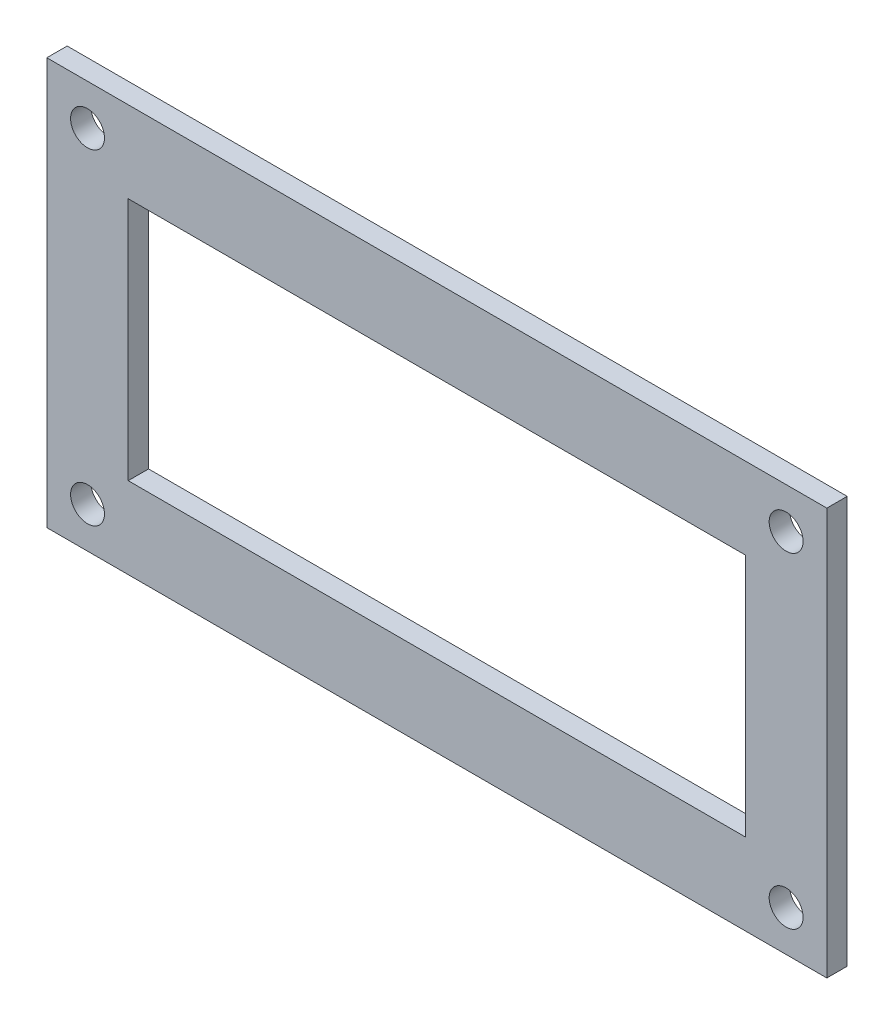
ISO-10303-21;
HEADER;
FILE_DESCRIPTION(('STEP AP214'),'2;1');
FILE_NAME('part.step','',(''),(''),'','','');
FILE_SCHEMA(('AUTOMOTIVE_DESIGN { 1 0 10303 214 1 1 1 1 }'));
ENDSEC;
DATA;
#1=APPLICATION_CONTEXT('core data for automotive mechanical design processes');
#2=APPLICATION_PROTOCOL_DEFINITION('international standard','automotive_design',2000,#1);
#3=PRODUCT_CONTEXT('',#1,'mechanical');
#4=PRODUCT('Part','Part','',(#3));
#5=PRODUCT_RELATED_PRODUCT_CATEGORY('part','',(#4));
#6=PRODUCT_DEFINITION_FORMATION('','',#4);
#7=PRODUCT_DEFINITION_CONTEXT('part definition',#1,'design');
#8=PRODUCT_DEFINITION('design','',#6,#7);
#9=PRODUCT_DEFINITION_SHAPE('','',#8);
#10=(LENGTH_UNIT() NAMED_UNIT(*) SI_UNIT(.MILLI.,.METRE.));
#11=(NAMED_UNIT(*) PLANE_ANGLE_UNIT() SI_UNIT($,.RADIAN.));
#12=(NAMED_UNIT(*) SI_UNIT($,.STERADIAN.) SOLID_ANGLE_UNIT());
#13=UNCERTAINTY_MEASURE_WITH_UNIT(LENGTH_MEASURE(1.E-05),#10,'distance_accuracy_value','');
#14=(GEOMETRIC_REPRESENTATION_CONTEXT(3) GLOBAL_UNCERTAINTY_ASSIGNED_CONTEXT((#13)) GLOBAL_UNIT_ASSIGNED_CONTEXT((#10,
#11,#12)) REPRESENTATION_CONTEXT('',''));
#15=CARTESIAN_POINT('',(0.,0.,0.));
#16=DIRECTION('',(0.,0.,1.));
#17=DIRECTION('',(1.,0.,0.));
#18=AXIS2_PLACEMENT_3D('',#15,#16,#17);
#19=CARTESIAN_POINT('',(0.,0.,3.));
#20=DIRECTION('',(0.,0.,-1.));
#21=DIRECTION('',(-1.,0.,0.));
#22=AXIS2_PLACEMENT_3D('',#19,#20,#21);
#23=PLANE('',#22);
#24=CARTESIAN_POINT('',(109.,6.,3.));
#25=DIRECTION('',(0.,0.,1.));
#26=DIRECTION('',(1.,0.,0.));
#27=AXIS2_PLACEMENT_3D('',#24,#25,#26);
#28=CIRCLE('',#27,2.49999999999999);
#29=CARTESIAN_POINT('',(111.5,6.,3.));
#30=VERTEX_POINT('',#29);
#31=EDGE_CURVE('E134',#30,#30,#28,.T.);
#32=ORIENTED_EDGE('',*,*,#31,.F.);
#33=EDGE_LOOP('',(#32));
#34=FACE_BOUND('',#33,.T.);
#35=CARTESIAN_POINT('',(6.,54.,3.));
#36=DIRECTION('',(0.,0.,1.));
#37=DIRECTION('',(1.,0.,0.));
#38=AXIS2_PLACEMENT_3D('',#35,#36,#37);
#39=CIRCLE('',#38,2.5);
#40=CARTESIAN_POINT('',(8.5,54.,3.));
#41=VERTEX_POINT('',#40);
#42=EDGE_CURVE('E146',#41,#41,#39,.T.);
#43=ORIENTED_EDGE('',*,*,#42,.F.);
#44=EDGE_LOOP('',(#43));
#45=FACE_BOUND('',#44,.T.);
#46=DIRECTION('',(0.,-1.,0.));
#47=VECTOR('',#46,1.);
#48=CARTESIAN_POINT('',(0.,0.,3.));
#49=LINE('',#48,#47);
#50=CARTESIAN_POINT('',(0.,60.,3.));
#51=VERTEX_POINT('',#50);
#52=CARTESIAN_POINT('',(0.,0.,3.));
#53=VERTEX_POINT('',#52);
#54=EDGE_CURVE('E158',#51,#53,#49,.T.);
#55=ORIENTED_EDGE('',*,*,#54,.T.);
#56=DIRECTION('',(1.,0.,0.));
#57=VECTOR('',#56,1.);
#58=CARTESIAN_POINT('',(0.,0.,3.));
#59=LINE('',#58,#57);
#60=CARTESIAN_POINT('',(115.,0.,3.));
#61=VERTEX_POINT('',#60);
#62=EDGE_CURVE('E161',#53,#61,#59,.T.);
#63=ORIENTED_EDGE('',*,*,#62,.T.);
#64=DIRECTION('',(0.,1.,0.));
#65=VECTOR('',#64,1.);
#66=CARTESIAN_POINT('',(115.,0.,3.));
#67=LINE('',#66,#65);
#68=CARTESIAN_POINT('',(115.,60.,3.));
#69=VERTEX_POINT('',#68);
#70=EDGE_CURVE('E164',#61,#69,#67,.T.);
#71=ORIENTED_EDGE('',*,*,#70,.T.);
#72=DIRECTION('',(-1.,0.,0.));
#73=VECTOR('',#72,1.);
#74=CARTESIAN_POINT('',(0.,60.,3.));
#75=LINE('',#74,#73);
#76=EDGE_CURVE('E166',#69,#51,#75,.T.);
#77=ORIENTED_EDGE('',*,*,#76,.T.);
#78=EDGE_LOOP('',(#55,#63,#71,#77));
#79=FACE_BOUND('',#78,.T.);
#80=CARTESIAN_POINT('',(6.,6.,3.));
#81=DIRECTION('',(0.,0.,1.));
#82=DIRECTION('',(1.,0.,0.));
#83=AXIS2_PLACEMENT_3D('',#80,#81,#82);
#84=CIRCLE('',#83,2.5);
#85=CARTESIAN_POINT('',(8.5,6.,3.));
#86=VERTEX_POINT('',#85);
#87=EDGE_CURVE('E152',#86,#86,#84,.T.);
#88=ORIENTED_EDGE('',*,*,#87,.F.);
#89=EDGE_LOOP('',(#88));
#90=FACE_BOUND('',#89,.T.);
#91=CARTESIAN_POINT('',(109.,54.,3.));
#92=DIRECTION('',(0.,0.,1.));
#93=DIRECTION('',(1.,0.,0.));
#94=AXIS2_PLACEMENT_3D('',#91,#92,#93);
#95=CIRCLE('',#94,2.50000000000001);
#96=CARTESIAN_POINT('',(111.5,54.,3.));
#97=VERTEX_POINT('',#96);
#98=EDGE_CURVE('E140',#97,#97,#95,.T.);
#99=ORIENTED_EDGE('',*,*,#98,.F.);
#100=EDGE_LOOP('',(#99));
#101=FACE_BOUND('',#100,.T.);
#102=DIRECTION('',(0.,-1.,0.));
#103=VECTOR('',#102,1.);
#104=CARTESIAN_POINT('',(12.,48.,3.));
#105=LINE('',#104,#103);
#106=CARTESIAN_POINT('',(12.,48.,3.));
#107=VERTEX_POINT('',#106);
#108=CARTESIAN_POINT('',(12.,12.,3.));
#109=VERTEX_POINT('',#108);
#110=EDGE_CURVE('E98',#107,#109,#105,.T.);
#111=ORIENTED_EDGE('',*,*,#110,.F.);
#112=DIRECTION('',(-1.,0.,0.));
#113=VECTOR('',#112,1.);
#114=CARTESIAN_POINT('',(12.,48.,3.));
#115=LINE('',#114,#113);
#116=CARTESIAN_POINT('',(103.,48.,3.));
#117=VERTEX_POINT('',#116);
#118=EDGE_CURVE('E120',#117,#107,#115,.T.);
#119=ORIENTED_EDGE('',*,*,#118,.F.);
#120=DIRECTION('',(0.,1.,0.));
#121=VECTOR('',#120,1.);
#122=CARTESIAN_POINT('',(103.,48.,3.));
#123=LINE('',#122,#121);
#124=CARTESIAN_POINT('',(103.,12.,3.));
#125=VERTEX_POINT('',#124);
#126=EDGE_CURVE('E118',#125,#117,#123,.T.);
#127=ORIENTED_EDGE('',*,*,#126,.F.);
#128=DIRECTION('',(1.,0.,0.));
#129=VECTOR('',#128,1.);
#130=CARTESIAN_POINT('',(12.,12.,3.));
#131=LINE('',#130,#129);
#132=EDGE_CURVE('E106',#109,#125,#131,.T.);
#133=ORIENTED_EDGE('',*,*,#132,.F.);
#134=EDGE_LOOP('',(#111,#119,#127,#133));
#135=FACE_BOUND('',#134,.T.);
#136=ADVANCED_FACE('F33',(#34,#45,#79,#90,#101,#135),#23,.F.);
#137=CARTESIAN_POINT('',(0.,0.,0.));
#138=DIRECTION('',(0.,0.,-1.));
#139=DIRECTION('',(-1.,0.,0.));
#140=AXIS2_PLACEMENT_3D('',#137,#138,#139);
#141=PLANE('',#140);
#142=CARTESIAN_POINT('',(109.,6.,0.));
#143=DIRECTION('',(0.,0.,1.));
#144=DIRECTION('',(1.,0.,0.));
#145=AXIS2_PLACEMENT_3D('',#142,#143,#144);
#146=CIRCLE('',#145,2.49999999999999);
#147=CARTESIAN_POINT('',(111.5,6.,0.));
#148=VERTEX_POINT('',#147);
#149=EDGE_CURVE('E114',#148,#148,#146,.T.);
#150=ORIENTED_EDGE('',*,*,#149,.T.);
#151=EDGE_LOOP('',(#150));
#152=FACE_BOUND('',#151,.T.);
#153=CARTESIAN_POINT('',(6.,54.,0.));
#154=DIRECTION('',(0.,0.,1.));
#155=DIRECTION('',(1.,0.,0.));
#156=AXIS2_PLACEMENT_3D('',#153,#154,#155);
#157=CIRCLE('',#156,2.5);
#158=CARTESIAN_POINT('',(8.5,54.,0.));
#159=VERTEX_POINT('',#158);
#160=EDGE_CURVE('E143',#159,#159,#157,.T.);
#161=ORIENTED_EDGE('',*,*,#160,.T.);
#162=EDGE_LOOP('',(#161));
#163=FACE_BOUND('',#162,.T.);
#164=DIRECTION('',(0.,-1.,0.));
#165=VECTOR('',#164,1.);
#166=CARTESIAN_POINT('',(0.,0.,0.));
#167=LINE('',#166,#165);
#168=CARTESIAN_POINT('',(0.,60.,0.));
#169=VERTEX_POINT('',#168);
#170=CARTESIAN_POINT('',(0.,0.,0.));
#171=VERTEX_POINT('',#170);
#172=EDGE_CURVE('E155',#169,#171,#167,.T.);
#173=ORIENTED_EDGE('',*,*,#172,.F.);
#174=DIRECTION('',(-1.,0.,0.));
#175=VECTOR('',#174,1.);
#176=CARTESIAN_POINT('',(0.,60.,0.));
#177=LINE('',#176,#175);
#178=CARTESIAN_POINT('',(115.,60.,0.));
#179=VERTEX_POINT('',#178);
#180=EDGE_CURVE('E162',#179,#169,#177,.T.);
#181=ORIENTED_EDGE('',*,*,#180,.F.);
#182=DIRECTION('',(0.,1.,0.));
#183=VECTOR('',#182,1.);
#184=CARTESIAN_POINT('',(115.,0.,0.));
#185=LINE('',#184,#183);
#186=CARTESIAN_POINT('',(115.,0.,0.));
#187=VERTEX_POINT('',#186);
#188=EDGE_CURVE('E173',#187,#179,#185,.T.);
#189=ORIENTED_EDGE('',*,*,#188,.F.);
#190=DIRECTION('',(1.,0.,0.));
#191=VECTOR('',#190,1.);
#192=CARTESIAN_POINT('',(0.,0.,0.));
#193=LINE('',#192,#191);
#194=EDGE_CURVE('E171',#171,#187,#193,.T.);
#195=ORIENTED_EDGE('',*,*,#194,.F.);
#196=EDGE_LOOP('',(#173,#181,#189,#195));
#197=FACE_BOUND('',#196,.T.);
#198=CARTESIAN_POINT('',(6.,6.,0.));
#199=DIRECTION('',(0.,0.,1.));
#200=DIRECTION('',(1.,0.,0.));
#201=AXIS2_PLACEMENT_3D('',#198,#199,#200);
#202=CIRCLE('',#201,2.5);
#203=CARTESIAN_POINT('',(8.5,6.,0.));
#204=VERTEX_POINT('',#203);
#205=EDGE_CURVE('E149',#204,#204,#202,.T.);
#206=ORIENTED_EDGE('',*,*,#205,.T.);
#207=EDGE_LOOP('',(#206));
#208=FACE_BOUND('',#207,.T.);
#209=CARTESIAN_POINT('',(109.,54.,0.));
#210=DIRECTION('',(0.,0.,1.));
#211=DIRECTION('',(1.,0.,0.));
#212=AXIS2_PLACEMENT_3D('',#209,#210,#211);
#213=CIRCLE('',#212,2.50000000000001);
#214=CARTESIAN_POINT('',(111.5,54.,0.));
#215=VERTEX_POINT('',#214);
#216=EDGE_CURVE('E137',#215,#215,#213,.T.);
#217=ORIENTED_EDGE('',*,*,#216,.T.);
#218=EDGE_LOOP('',(#217));
#219=FACE_BOUND('',#218,.T.);
#220=DIRECTION('',(-1.,0.,0.));
#221=VECTOR('',#220,1.);
#222=CARTESIAN_POINT('',(12.,48.,0.));
#223=LINE('',#222,#221);
#224=CARTESIAN_POINT('',(103.,48.,0.));
#225=VERTEX_POINT('',#224);
#226=CARTESIAN_POINT('',(12.,48.,0.));
#227=VERTEX_POINT('',#226);
#228=EDGE_CURVE('E107',#225,#227,#223,.T.);
#229=ORIENTED_EDGE('',*,*,#228,.T.);
#230=DIRECTION('',(0.,-1.,0.));
#231=VECTOR('',#230,1.);
#232=CARTESIAN_POINT('',(12.,48.,0.));
#233=LINE('',#232,#231);
#234=CARTESIAN_POINT('',(12.,12.,0.));
#235=VERTEX_POINT('',#234);
#236=EDGE_CURVE('E56',#227,#235,#233,.T.);
#237=ORIENTED_EDGE('',*,*,#236,.T.);
#238=DIRECTION('',(1.,0.,0.));
#239=VECTOR('',#238,1.);
#240=CARTESIAN_POINT('',(12.,12.,0.));
#241=LINE('',#240,#239);
#242=CARTESIAN_POINT('',(103.,12.,0.));
#243=VERTEX_POINT('',#242);
#244=EDGE_CURVE('E113',#235,#243,#241,.T.);
#245=ORIENTED_EDGE('',*,*,#244,.T.);
#246=DIRECTION('',(0.,1.,0.));
#247=VECTOR('',#246,1.);
#248=CARTESIAN_POINT('',(103.,48.,0.));
#249=LINE('',#248,#247);
#250=EDGE_CURVE('E126',#243,#225,#249,.T.);
#251=ORIENTED_EDGE('',*,*,#250,.T.);
#252=EDGE_LOOP('',(#229,#237,#245,#251));
#253=FACE_BOUND('',#252,.T.);
#254=ADVANCED_FACE('F191',(#152,#163,#197,#208,#219,#253),#141,.T.);
#255=CARTESIAN_POINT('',(0.,0.,3.));
#256=DIRECTION('',(1.,0.,0.));
#257=DIRECTION('',(0.,0.,-1.));
#258=AXIS2_PLACEMENT_3D('',#255,#256,#257);
#259=PLANE('',#258);
#260=ORIENTED_EDGE('',*,*,#172,.T.);
#261=DIRECTION('',(0.,0.,-1.));
#262=VECTOR('',#261,1.);
#263=CARTESIAN_POINT('',(0.,0.,3.));
#264=LINE('',#263,#262);
#265=EDGE_CURVE('E11',#53,#171,#264,.T.);
#266=ORIENTED_EDGE('',*,*,#265,.F.);
#267=ORIENTED_EDGE('',*,*,#54,.F.);
#268=DIRECTION('',(0.,0.,-1.));
#269=VECTOR('',#268,1.);
#270=CARTESIAN_POINT('',(0.,60.,3.));
#271=LINE('',#270,#269);
#272=EDGE_CURVE('E168',#51,#169,#271,.T.);
#273=ORIENTED_EDGE('',*,*,#272,.T.);
#274=EDGE_LOOP('',(#260,#266,#267,#273));
#275=FACE_BOUND('',#274,.T.);
#276=ADVANCED_FACE('F35',(#275),#259,.F.);
#277=CARTESIAN_POINT('',(0.,0.,3.));
#278=DIRECTION('',(0.,1.,0.));
#279=DIRECTION('',(0.,0.,1.));
#280=AXIS2_PLACEMENT_3D('',#277,#278,#279);
#281=PLANE('',#280);
#282=ORIENTED_EDGE('',*,*,#194,.T.);
#283=DIRECTION('',(0.,0.,-1.));
#284=VECTOR('',#283,1.);
#285=CARTESIAN_POINT('',(115.,0.,3.));
#286=LINE('',#285,#284);
#287=EDGE_CURVE('E41',#61,#187,#286,.T.);
#288=ORIENTED_EDGE('',*,*,#287,.F.);
#289=ORIENTED_EDGE('',*,*,#62,.F.);
#290=ORIENTED_EDGE('',*,*,#265,.T.);
#291=EDGE_LOOP('',(#282,#288,#289,#290));
#292=FACE_BOUND('',#291,.T.);
#293=ADVANCED_FACE('F202',(#292),#281,.F.);
#294=CARTESIAN_POINT('',(115.,0.,3.));
#295=DIRECTION('',(-1.,0.,0.));
#296=DIRECTION('',(0.,0.,1.));
#297=AXIS2_PLACEMENT_3D('',#294,#295,#296);
#298=PLANE('',#297);
#299=ORIENTED_EDGE('',*,*,#188,.T.);
#300=DIRECTION('',(0.,0.,-1.));
#301=VECTOR('',#300,1.);
#302=CARTESIAN_POINT('',(115.,60.,3.));
#303=LINE('',#302,#301);
#304=EDGE_CURVE('E178',#69,#179,#303,.T.);
#305=ORIENTED_EDGE('',*,*,#304,.F.);
#306=ORIENTED_EDGE('',*,*,#70,.F.);
#307=ORIENTED_EDGE('',*,*,#287,.T.);
#308=EDGE_LOOP('',(#299,#305,#306,#307));
#309=FACE_BOUND('',#308,.T.);
#310=ADVANCED_FACE('F185',(#309),#298,.F.);
#311=CARTESIAN_POINT('',(0.,60.,3.));
#312=DIRECTION('',(0.,-1.,0.));
#313=DIRECTION('',(0.,0.,-1.));
#314=AXIS2_PLACEMENT_3D('',#311,#312,#313);
#315=PLANE('',#314);
#316=ORIENTED_EDGE('',*,*,#180,.T.);
#317=ORIENTED_EDGE('',*,*,#272,.F.);
#318=ORIENTED_EDGE('',*,*,#76,.F.);
#319=ORIENTED_EDGE('',*,*,#304,.T.);
#320=EDGE_LOOP('',(#316,#317,#318,#319));
#321=FACE_BOUND('',#320,.T.);
#322=ADVANCED_FACE('F195',(#321),#315,.F.);
#323=CARTESIAN_POINT('',(6.,6.,3.));
#324=DIRECTION('',(0.,0.,-1.));
#325=DIRECTION('',(-1.,0.,0.));
#326=AXIS2_PLACEMENT_3D('',#323,#324,#325);
#327=CYLINDRICAL_SURFACE('',#326,2.5);
#328=ORIENTED_EDGE('',*,*,#87,.T.);
#329=EDGE_LOOP('',(#328));
#330=FACE_BOUND('',#329,.T.);
#331=ORIENTED_EDGE('',*,*,#205,.F.);
#332=EDGE_LOOP('',(#331));
#333=FACE_BOUND('',#332,.T.);
#334=ADVANCED_FACE('F220',(#330,#333),#327,.F.);
#335=CARTESIAN_POINT('',(6.,54.,3.));
#336=DIRECTION('',(0.,0.,-1.));
#337=DIRECTION('',(-1.,0.,0.));
#338=AXIS2_PLACEMENT_3D('',#335,#336,#337);
#339=CYLINDRICAL_SURFACE('',#338,2.5);
#340=ORIENTED_EDGE('',*,*,#42,.T.);
#341=EDGE_LOOP('',(#340));
#342=FACE_BOUND('',#341,.T.);
#343=ORIENTED_EDGE('',*,*,#160,.F.);
#344=EDGE_LOOP('',(#343));
#345=FACE_BOUND('',#344,.T.);
#346=ADVANCED_FACE('F227',(#342,#345),#339,.F.);
#347=CARTESIAN_POINT('',(109.,54.,3.));
#348=DIRECTION('',(0.,0.,-1.));
#349=DIRECTION('',(-1.,0.,0.));
#350=AXIS2_PLACEMENT_3D('',#347,#348,#349);
#351=CYLINDRICAL_SURFACE('',#350,2.50000000000001);
#352=ORIENTED_EDGE('',*,*,#98,.T.);
#353=EDGE_LOOP('',(#352));
#354=FACE_BOUND('',#353,.T.);
#355=ORIENTED_EDGE('',*,*,#216,.F.);
#356=EDGE_LOOP('',(#355));
#357=FACE_BOUND('',#356,.T.);
#358=ADVANCED_FACE('F232',(#354,#357),#351,.F.);
#359=CARTESIAN_POINT('',(109.,6.,3.));
#360=DIRECTION('',(0.,0.,-1.));
#361=DIRECTION('',(-1.,0.,0.));
#362=AXIS2_PLACEMENT_3D('',#359,#360,#361);
#363=CYLINDRICAL_SURFACE('',#362,2.49999999999999);
#364=ORIENTED_EDGE('',*,*,#31,.T.);
#365=EDGE_LOOP('',(#364));
#366=FACE_BOUND('',#365,.T.);
#367=ORIENTED_EDGE('',*,*,#149,.F.);
#368=EDGE_LOOP('',(#367));
#369=FACE_BOUND('',#368,.T.);
#370=ADVANCED_FACE('F255',(#366,#369),#363,.F.);
#371=CARTESIAN_POINT('',(12.,48.,3.));
#372=DIRECTION('',(1.,0.,0.));
#373=DIRECTION('',(0.,1.,0.));
#374=AXIS2_PLACEMENT_3D('',#371,#372,#373);
#375=PLANE('',#374);
#376=ORIENTED_EDGE('',*,*,#236,.F.);
#377=DIRECTION('',(0.,0.,-1.));
#378=VECTOR('',#377,1.);
#379=CARTESIAN_POINT('',(12.,48.,3.));
#380=LINE('',#379,#378);
#381=EDGE_CURVE('E102',#107,#227,#380,.T.);
#382=ORIENTED_EDGE('',*,*,#381,.F.);
#383=ORIENTED_EDGE('',*,*,#110,.T.);
#384=DIRECTION('',(0.,0.,-1.));
#385=VECTOR('',#384,1.);
#386=CARTESIAN_POINT('',(12.,12.,3.));
#387=LINE('',#386,#385);
#388=EDGE_CURVE('E101',#109,#235,#387,.T.);
#389=ORIENTED_EDGE('',*,*,#388,.T.);
#390=EDGE_LOOP('',(#376,#382,#383,#389));
#391=FACE_BOUND('',#390,.T.);
#392=ADVANCED_FACE('F100',(#391),#375,.T.);
#393=CARTESIAN_POINT('',(12.,12.,3.));
#394=DIRECTION('',(0.,1.,0.));
#395=DIRECTION('',(0.,0.,1.));
#396=AXIS2_PLACEMENT_3D('',#393,#394,#395);
#397=PLANE('',#396);
#398=ORIENTED_EDGE('',*,*,#244,.F.);
#399=ORIENTED_EDGE('',*,*,#388,.F.);
#400=ORIENTED_EDGE('',*,*,#132,.T.);
#401=DIRECTION('',(0.,0.,-1.));
#402=VECTOR('',#401,1.);
#403=CARTESIAN_POINT('',(103.,12.,3.));
#404=LINE('',#403,#402);
#405=EDGE_CURVE('E115',#125,#243,#404,.T.);
#406=ORIENTED_EDGE('',*,*,#405,.T.);
#407=EDGE_LOOP('',(#398,#399,#400,#406));
#408=FACE_BOUND('',#407,.T.);
#409=ADVANCED_FACE('F110',(#408),#397,.T.);
#410=CARTESIAN_POINT('',(103.,48.,3.));
#411=DIRECTION('',(-1.,0.,0.));
#412=DIRECTION('',(0.,0.,1.));
#413=AXIS2_PLACEMENT_3D('',#410,#411,#412);
#414=PLANE('',#413);
#415=ORIENTED_EDGE('',*,*,#250,.F.);
#416=ORIENTED_EDGE('',*,*,#405,.F.);
#417=ORIENTED_EDGE('',*,*,#126,.T.);
#418=DIRECTION('',(0.,0.,-1.));
#419=VECTOR('',#418,1.);
#420=CARTESIAN_POINT('',(103.,48.,3.));
#421=LINE('',#420,#419);
#422=EDGE_CURVE('E48',#117,#225,#421,.T.);
#423=ORIENTED_EDGE('',*,*,#422,.T.);
#424=EDGE_LOOP('',(#415,#416,#417,#423));
#425=FACE_BOUND('',#424,.T.);
#426=ADVANCED_FACE('F243',(#425),#414,.T.);
#427=CARTESIAN_POINT('',(12.,48.,3.));
#428=DIRECTION('',(0.,-1.,0.));
#429=DIRECTION('',(0.,0.,-1.));
#430=AXIS2_PLACEMENT_3D('',#427,#428,#429);
#431=PLANE('',#430);
#432=ORIENTED_EDGE('',*,*,#228,.F.);
#433=ORIENTED_EDGE('',*,*,#422,.F.);
#434=ORIENTED_EDGE('',*,*,#118,.T.);
#435=ORIENTED_EDGE('',*,*,#381,.T.);
#436=EDGE_LOOP('',(#432,#433,#434,#435));
#437=FACE_BOUND('',#436,.T.);
#438=ADVANCED_FACE('F241',(#437),#431,.T.);
#439=CLOSED_SHELL('',(#136,#254,#276,#293,#310,#322,#334,#346,#358,#370,#392,#409,#426,#438));
#440=MANIFOLD_SOLID_BREP('B2',#439);
#441=ADVANCED_BREP_SHAPE_REPRESENTATION('',(#18,#440),#14);
#442=SHAPE_DEFINITION_REPRESENTATION(#9,#441);
ENDSEC;
END-ISO-10303-21;
